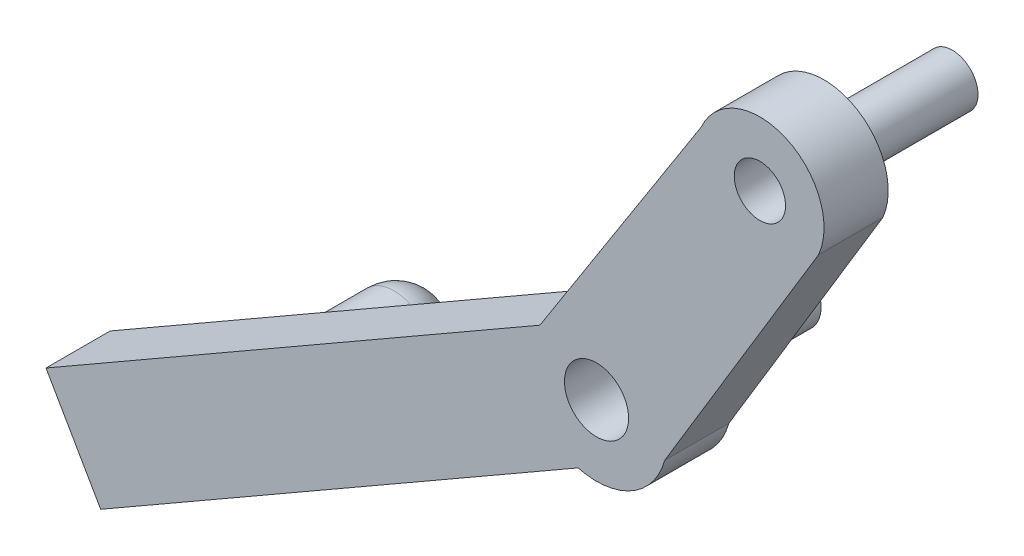
ISO-10303-21;
HEADER;
FILE_DESCRIPTION(('STEP AP214'),'2;1');
FILE_NAME('part.step','',(''),(''),'','','');
FILE_SCHEMA(('AUTOMOTIVE_DESIGN { 1 0 10303 214 1 1 1 1 }'));
ENDSEC;
DATA;
#1=APPLICATION_CONTEXT('core data for automotive mechanical design processes');
#2=APPLICATION_PROTOCOL_DEFINITION('international standard','automotive_design',2000,#1);
#3=PRODUCT_CONTEXT('',#1,'mechanical');
#4=PRODUCT('Part','Part','',(#3));
#5=PRODUCT_RELATED_PRODUCT_CATEGORY('part','',(#4));
#6=PRODUCT_DEFINITION_FORMATION('','',#4);
#7=PRODUCT_DEFINITION_CONTEXT('part definition',#1,'design');
#8=PRODUCT_DEFINITION('design','',#6,#7);
#9=PRODUCT_DEFINITION_SHAPE('','',#8);
#10=(LENGTH_UNIT() NAMED_UNIT(*) SI_UNIT(.MILLI.,.METRE.));
#11=(NAMED_UNIT(*) PLANE_ANGLE_UNIT() SI_UNIT($,.RADIAN.));
#12=(NAMED_UNIT(*) SI_UNIT($,.STERADIAN.) SOLID_ANGLE_UNIT());
#13=UNCERTAINTY_MEASURE_WITH_UNIT(LENGTH_MEASURE(1.E-05),#10,'distance_accuracy_value','');
#14=(GEOMETRIC_REPRESENTATION_CONTEXT(3) GLOBAL_UNCERTAINTY_ASSIGNED_CONTEXT((#13)) GLOBAL_UNIT_ASSIGNED_CONTEXT((#10,
#11,#12)) REPRESENTATION_CONTEXT('',''));
#15=CARTESIAN_POINT('',(0.,0.,0.));
#16=DIRECTION('',(0.,0.,1.));
#17=DIRECTION('',(1.,0.,0.));
#18=AXIS2_PLACEMENT_3D('',#15,#16,#17);
#19=CARTESIAN_POINT('',(2.48034743292827,-4.35301832543163,-15.));
#20=DIRECTION('',(0.,0.,1.));
#21=DIRECTION('',(-1.,0.,0.));
#22=AXIS2_PLACEMENT_3D('',#19,#20,#21);
#23=CYLINDRICAL_SURFACE('',#22,2.5);
#24=CARTESIAN_POINT('',(2.48034743292827,-4.35301832543163,-15.));
#25=DIRECTION('',(0.,0.,1.));
#26=DIRECTION('',(1.,0.,0.));
#27=AXIS2_PLACEMENT_3D('',#24,#25,#26);
#28=CIRCLE('',#27,2.5);
#29=CARTESIAN_POINT('',(4.98034743292827,-4.35301832543163,-15.));
#30=VERTEX_POINT('',#29);
#31=EDGE_CURVE('E11',#30,#30,#28,.T.);
#32=ORIENTED_EDGE('',*,*,#31,.T.);
#33=EDGE_LOOP('',(#32));
#34=FACE_BOUND('',#33,.T.);
#35=CARTESIAN_POINT('',(2.48034743292827,-4.35301832543163,-5.));
#36=DIRECTION('',(0.,0.,1.));
#37=DIRECTION('',(1.,0.,0.));
#38=AXIS2_PLACEMENT_3D('',#35,#36,#37);
#39=CIRCLE('',#38,2.5);
#40=CARTESIAN_POINT('',(4.98034743292827,-4.35301832543163,-5.));
#41=VERTEX_POINT('',#40);
#42=EDGE_CURVE('E47',#41,#41,#39,.T.);
#43=ORIENTED_EDGE('',*,*,#42,.F.);
#44=EDGE_LOOP('',(#43));
#45=FACE_BOUND('',#44,.T.);
#46=ADVANCED_FACE('F44',(#34,#45),#23,.T.);
#47=CARTESIAN_POINT('',(2.48034743292827,-4.35301832543163,-15.));
#48=DIRECTION('',(0.,0.,-1.));
#49=DIRECTION('',(1.,0.,0.));
#50=AXIS2_PLACEMENT_3D('',#47,#48,#49);
#51=PLANE('',#50);
#52=ORIENTED_EDGE('',*,*,#31,.F.);
#53=EDGE_LOOP('',(#52));
#54=FACE_BOUND('',#53,.T.);
#55=ADVANCED_FACE('F59',(#54),#51,.T.);
#56=CARTESIAN_POINT('',(2.48034743292827,-4.35301832543163,-5.));
#57=DIRECTION('',(0.,0.,-1.));
#58=DIRECTION('',(1.,0.,0.));
#59=AXIS2_PLACEMENT_3D('',#56,#57,#58);
#60=PLANE('',#59);
#61=ORIENTED_EDGE('',*,*,#42,.T.);
#62=EDGE_LOOP('',(#61));
#63=FACE_BOUND('',#62,.T.);
#64=ADVANCED_FACE('F56',(#63),#60,.F.);
#65=CLOSED_SHELL('',(#46,#55,#64));
#66=MANIFOLD_SOLID_BREP('B2',#65);
#67=CARTESIAN_POINT('',(15.2131519884464,16.1187767320402,-15.));
#68=DIRECTION('',(0.,0.,1.));
#69=DIRECTION('',(-1.,0.,0.));
#70=AXIS2_PLACEMENT_3D('',#67,#68,#69);
#71=CYLINDRICAL_SURFACE('',#70,2.);
#72=CARTESIAN_POINT('',(15.2131519884464,16.1187767320402,-15.));
#73=DIRECTION('',(0.,0.,1.));
#74=DIRECTION('',(1.,0.,0.));
#75=AXIS2_PLACEMENT_3D('',#72,#73,#74);
#76=CIRCLE('',#75,2.);
#77=CARTESIAN_POINT('',(17.2131519884464,16.1187767320402,-15.));
#78=VERTEX_POINT('',#77);
#79=EDGE_CURVE('E43',#78,#78,#76,.T.);
#80=ORIENTED_EDGE('',*,*,#79,.T.);
#81=EDGE_LOOP('',(#80));
#82=FACE_BOUND('',#81,.T.);
#83=CARTESIAN_POINT('',(15.2131519884464,16.1187767320402,-5.));
#84=DIRECTION('',(0.,0.,1.));
#85=DIRECTION('',(1.,0.,0.));
#86=AXIS2_PLACEMENT_3D('',#83,#84,#85);
#87=CIRCLE('',#86,2.);
#88=CARTESIAN_POINT('',(17.2131519884464,16.1187767320402,-5.));
#89=VERTEX_POINT('',#88);
#90=EDGE_CURVE('E97',#89,#89,#87,.T.);
#91=ORIENTED_EDGE('',*,*,#90,.F.);
#92=EDGE_LOOP('',(#91));
#93=FACE_BOUND('',#92,.T.);
#94=ADVANCED_FACE('F94',(#82,#93),#71,.T.);
#95=CARTESIAN_POINT('',(15.2131519884464,16.1187767320402,-15.));
#96=DIRECTION('',(0.,0.,-1.));
#97=DIRECTION('',(1.,0.,0.));
#98=AXIS2_PLACEMENT_3D('',#95,#96,#97);
#99=PLANE('',#98);
#100=ORIENTED_EDGE('',*,*,#79,.F.);
#101=EDGE_LOOP('',(#100));
#102=FACE_BOUND('',#101,.T.);
#103=ADVANCED_FACE('F109',(#102),#99,.T.);
#104=CARTESIAN_POINT('',(15.2131519884464,16.1187767320402,-5.));
#105=DIRECTION('',(0.,0.,-1.));
#106=DIRECTION('',(1.,0.,0.));
#107=AXIS2_PLACEMENT_3D('',#104,#105,#106);
#108=PLANE('',#107);
#109=ORIENTED_EDGE('',*,*,#90,.T.);
#110=EDGE_LOOP('',(#109));
#111=FACE_BOUND('',#110,.T.);
#112=ADVANCED_FACE('F106',(#111),#108,.F.);
#113=CLOSED_SHELL('',(#94,#103,#112));
#114=MANIFOLD_SOLID_BREP('B6',#113);
#115=CARTESIAN_POINT('',(-25.2931810081454,-19.8826359089883,-15.));
#116=DIRECTION('',(0.,0.,1.));
#117=DIRECTION('',(-1.,0.,0.));
#118=AXIS2_PLACEMENT_3D('',#115,#116,#117);
#119=CYLINDRICAL_SURFACE('',#118,3.);
#120=CARTESIAN_POINT('',(-25.2931810081454,-19.8826359089883,-5.));
#121=DIRECTION('',(0.,0.,1.));
#122=DIRECTION('',(1.,0.,0.));
#123=AXIS2_PLACEMENT_3D('',#120,#121,#122);
#124=CIRCLE('',#123,3.);
#125=CARTESIAN_POINT('',(-22.2931810081454,-19.8826359089883,-5.));
#126=VERTEX_POINT('',#125);
#127=EDGE_CURVE('E237',#126,#126,#124,.T.);
#128=ORIENTED_EDGE('',*,*,#127,.F.);
#129=EDGE_LOOP('',(#128));
#130=FACE_BOUND('',#129,.T.);
#131=CARTESIAN_POINT('',(-25.2931810081454,-19.8826359089884,-12.));
#132=DIRECTION('',(0.,0.,1.));
#133=DIRECTION('',(1.,0.,0.));
#134=AXIS2_PLACEMENT_3D('',#131,#132,#133);
#135=CIRCLE('',#134,3.);
#136=CARTESIAN_POINT('',(-22.2931810081454,-19.8826359089884,-12.));
#137=VERTEX_POINT('',#136);
#138=EDGE_CURVE('E414',#137,#137,#135,.T.);
#139=ORIENTED_EDGE('',*,*,#138,.T.);
#140=EDGE_LOOP('',(#139));
#141=FACE_BOUND('',#140,.T.);
#142=ADVANCED_FACE('F135',(#130,#141),#119,.T.);
#143=CARTESIAN_POINT('',(-0.682703439514869,0.436635830889686,-5.));
#144=DIRECTION('',(-0.842436284988127,0.538795977838925,0.));
#145=DIRECTION('',(-0.538795977838925,-0.842436284988127,0.));
#146=AXIS2_PLACEMENT_3D('',#143,#144,#145);
#147=PLANE('',#146);
#148=DIRECTION('',(0.538795977838925,0.842436284988127,0.));
#149=VECTOR('',#148,1.);
#150=CARTESIAN_POINT('',(-0.682703439514869,0.436635830889686,0.));
#151=LINE('',#150,#149);
#152=CARTESIAN_POINT('',(-1.93424021867878,-1.52020875988425,0.));
#153=VERTEX_POINT('',#152);
#154=CARTESIAN_POINT('',(10.6400793801503,18.1404114466345,0.));
#155=VERTEX_POINT('',#154);
#156=EDGE_CURVE('E233',#153,#155,#151,.T.);
#157=ORIENTED_EDGE('',*,*,#156,.T.);
#158=DIRECTION('',(0.,0.,1.));
#159=VECTOR('',#158,1.);
#160=CARTESIAN_POINT('',(10.6400793801503,18.1404114466345,-5.));
#161=LINE('',#160,#159);
#162=CARTESIAN_POINT('',(10.6400793801503,18.1404114466345,-5.));
#163=VERTEX_POINT('',#162);
#164=EDGE_CURVE('E232',#163,#155,#161,.T.);
#165=ORIENTED_EDGE('',*,*,#164,.F.);
#166=DIRECTION('',(0.538795977838925,0.842436284988127,0.));
#167=VECTOR('',#166,1.);
#168=CARTESIAN_POINT('',(-0.682703439514869,0.436635830889686,-5.));
#169=LINE('',#168,#167);
#170=CARTESIAN_POINT('',(-1.93424021867878,-1.52020875988425,-5.));
#171=VERTEX_POINT('',#170);
#172=EDGE_CURVE('E255',#171,#163,#169,.T.);
#173=ORIENTED_EDGE('',*,*,#172,.F.);
#174=DIRECTION('',(0.,0.,1.));
#175=VECTOR('',#174,1.);
#176=CARTESIAN_POINT('',(-1.93424021867878,-1.52020875988425,-5.));
#177=LINE('',#176,#175);
#178=EDGE_CURVE('E92',#171,#153,#177,.T.);
#179=ORIENTED_EDGE('',*,*,#178,.T.);
#180=EDGE_LOOP('',(#157,#165,#173,#179));
#181=FACE_BOUND('',#180,.T.);
#182=ADVANCED_FACE('F137',(#181),#147,.T.);
#183=CARTESIAN_POINT('',(0.17625658415401,-0.30648591573246,-5.));
#184=DIRECTION('',(-0.498528903536302,0.866873077410351,0.));
#185=DIRECTION('',(-0.866873077410351,-0.498528903536302,0.));
#186=AXIS2_PLACEMENT_3D('',#183,#184,#185);
#187=PLANE('',#186);
#188=DIRECTION('',(0.866873077410351,0.498528903536302,0.));
#189=VECTOR('',#188,1.);
#190=CARTESIAN_POINT('',(0.17625658415401,-0.30648591573246,0.));
#191=LINE('',#190,#189);
#192=CARTESIAN_POINT('',(-40.4263847840177,-23.6566057999731,0.));
#193=VERTEX_POINT('',#192);
#194=EDGE_CURVE('E236',#193,#153,#191,.T.);
#195=ORIENTED_EDGE('',*,*,#194,.T.);
#196=ORIENTED_EDGE('',*,*,#178,.F.);
#197=DIRECTION('',(0.866873077410351,0.498528903536302,0.));
#198=VECTOR('',#197,1.);
#199=CARTESIAN_POINT('',(0.17625658415401,-0.30648591573246,-5.));
#200=LINE('',#199,#198);
#201=CARTESIAN_POINT('',(-40.4263847840177,-23.6566057999731,-5.));
#202=VERTEX_POINT('',#201);
#203=EDGE_CURVE('E187',#202,#171,#200,.T.);
#204=ORIENTED_EDGE('',*,*,#203,.F.);
#205=DIRECTION('',(0.,0.,1.));
#206=VECTOR('',#205,1.);
#207=CARTESIAN_POINT('',(-40.4263847840177,-23.6566057999731,-5.));
#208=LINE('',#207,#206);
#209=EDGE_CURVE('E144',#202,#193,#208,.T.);
#210=ORIENTED_EDGE('',*,*,#209,.T.);
#211=EDGE_LOOP('',(#195,#196,#204,#210));
#212=FACE_BOUND('',#211,.T.);
#213=ADVANCED_FACE('F265',(#212),#187,.T.);
#214=CARTESIAN_POINT('',(-40.6026413681717,-23.3501198842406,-5.));
#215=DIRECTION('',(0.866873077410351,0.498528903536302,0.));
#216=DIRECTION('',(-0.498528903536302,0.866873077410351,0.));
#217=AXIS2_PLACEMENT_3D('',#214,#215,#216);
#218=PLANE('',#217);
#219=DIRECTION('',(0.498528903536302,-0.866873077410351,0.));
#220=VECTOR('',#219,1.);
#221=CARTESIAN_POINT('',(-40.6026413681717,-23.3501198842406,0.));
#222=LINE('',#221,#220);
#223=CARTESIAN_POINT('',(-36.1661695545836,-31.0645331240926,0.));
#224=VERTEX_POINT('',#223);
#225=EDGE_CURVE('E239',#193,#224,#222,.T.);
#226=ORIENTED_EDGE('',*,*,#225,.F.);
#227=ORIENTED_EDGE('',*,*,#209,.F.);
#228=DIRECTION('',(0.498528903536302,-0.866873077410351,0.));
#229=VECTOR('',#228,1.);
#230=CARTESIAN_POINT('',(-40.6026413681717,-23.3501198842406,-5.));
#231=LINE('',#230,#229);
#232=CARTESIAN_POINT('',(-36.1661695545836,-31.0645331240926,-5.));
#233=VERTEX_POINT('',#232);
#234=EDGE_CURVE('E221',#202,#233,#231,.T.);
#235=ORIENTED_EDGE('',*,*,#234,.T.);
#236=DIRECTION('',(0.,0.,1.));
#237=VECTOR('',#236,1.);
#238=CARTESIAN_POINT('',(-36.1661695545836,-31.0645331240926,-5.));
#239=LINE('',#238,#237);
#240=EDGE_CURVE('E259',#233,#224,#239,.T.);
#241=ORIENTED_EDGE('',*,*,#240,.T.);
#242=EDGE_LOOP('',(#226,#227,#235,#241));
#243=FACE_BOUND('',#242,.T.);
#244=ADVANCED_FACE('F277',(#243),#218,.F.);
#245=CARTESIAN_POINT('',(4.43647181358803,-7.71441323985198,-5.));
#246=DIRECTION('',(-0.498528903536302,0.866873077410351,0.));
#247=DIRECTION('',(-0.866873077410351,-0.498528903536302,0.));
#248=AXIS2_PLACEMENT_3D('',#245,#246,#247);
#249=PLANE('',#248);
#250=DIRECTION('',(0.866873077410351,0.498528903536302,0.));
#251=VECTOR('',#250,1.);
#252=CARTESIAN_POINT('',(4.43647181358803,-7.71441323985198,0.));
#253=LINE('',#252,#251);
#254=CARTESIAN_POINT('',(1.04782478556533,-9.66318582418271,0.));
#255=VERTEX_POINT('',#254);
#256=EDGE_CURVE('E242',#224,#255,#253,.T.);
#257=ORIENTED_EDGE('',*,*,#256,.F.);
#258=ORIENTED_EDGE('',*,*,#240,.F.);
#259=DIRECTION('',(0.866873077410351,0.498528903536302,0.));
#260=VECTOR('',#259,1.);
#261=CARTESIAN_POINT('',(4.43647181358803,-7.71441323985198,-5.));
#262=LINE('',#261,#260);
#263=CARTESIAN_POINT('',(1.04782478556533,-9.66318582418271,-5.));
#264=VERTEX_POINT('',#263);
#265=EDGE_CURVE('E219',#233,#264,#262,.T.);
#266=ORIENTED_EDGE('',*,*,#265,.T.);
#267=DIRECTION('',(0.,0.,1.));
#268=VECTOR('',#267,1.);
#269=CARTESIAN_POINT('',(1.04782478556533,-9.66318582418271,-5.));
#270=LINE('',#269,#268);
#271=EDGE_CURVE('E213',#264,#255,#270,.T.);
#272=ORIENTED_EDGE('',*,*,#271,.T.);
#273=EDGE_LOOP('',(#257,#258,#266,#272));
#274=FACE_BOUND('',#273,.T.);
#275=ADVANCED_FACE('F280',(#274),#249,.F.);
#276=CARTESIAN_POINT('',(2.48034743292827,-4.35301832543163,-5.));
#277=DIRECTION('',(0.,0.,1.));
#278=DIRECTION('',(-1.,0.,0.));
#279=AXIS2_PLACEMENT_3D('',#276,#277,#278);
#280=CYLINDRICAL_SURFACE('',#279,5.5);
#281=CARTESIAN_POINT('',(2.48034743292827,-4.35301832543163,0.));
#282=DIRECTION('',(0.,0.,1.));
#283=DIRECTION('',(1.,0.,0.));
#284=AXIS2_PLACEMENT_3D('',#281,#282,#283);
#285=CIRCLE('',#284,5.5);
#286=CARTESIAN_POINT('',(7.79051493167935,-5.78554097279456,0.));
#287=VERTEX_POINT('',#286);
#288=EDGE_CURVE('E245',#255,#287,#285,.T.);
#289=ORIENTED_EDGE('',*,*,#288,.F.);
#290=ORIENTED_EDGE('',*,*,#271,.F.);
#291=CARTESIAN_POINT('',(2.48034743292827,-4.35301832543163,-5.));
#292=DIRECTION('',(0.,0.,1.));
#293=DIRECTION('',(1.,0.,0.));
#294=AXIS2_PLACEMENT_3D('',#291,#292,#293);
#295=CIRCLE('',#294,5.5);
#296=CARTESIAN_POINT('',(7.79051493167935,-5.78554097279456,-5.));
#297=VERTEX_POINT('',#296);
#298=EDGE_CURVE('E203',#264,#297,#295,.T.);
#299=ORIENTED_EDGE('',*,*,#298,.T.);
#300=DIRECTION('',(0.,0.,1.));
#301=VECTOR('',#300,1.);
#302=CARTESIAN_POINT('',(7.79051493167935,-5.78554097279456,-5.));
#303=LINE('',#302,#301);
#304=EDGE_CURVE('E208',#297,#287,#303,.T.);
#305=ORIENTED_EDGE('',*,*,#304,.T.);
#306=EDGE_LOOP('',(#289,#290,#299,#305));
#307=FACE_BOUND('',#306,.T.);
#308=ADVANCED_FACE('F216',(#307),#280,.T.);
#309=CARTESIAN_POINT('',(8.27057905312399,-4.98984292672802,-5.));
#310=DIRECTION('',(-0.856234541670631,0.51658727205583,0.));
#311=DIRECTION('',(-0.51658727205583,-0.856234541670632,0.));
#312=AXIS2_PLACEMENT_3D('',#309,#310,#311);
#313=PLANE('',#312);
#314=DIRECTION('',(0.51658727205583,0.856234541670631,0.));
#315=VECTOR('',#314,1.);
#316=CARTESIAN_POINT('',(8.27057905312399,-4.98984292672802,0.));
#317=LINE('',#316,#315);
#318=CARTESIAN_POINT('',(19.7862245967424,14.097142017446,0.));
#319=VERTEX_POINT('',#318);
#320=EDGE_CURVE('E210',#287,#319,#317,.T.);
#321=ORIENTED_EDGE('',*,*,#320,.F.);
#322=ORIENTED_EDGE('',*,*,#304,.F.);
#323=DIRECTION('',(0.51658727205583,0.856234541670631,0.));
#324=VECTOR('',#323,1.);
#325=CARTESIAN_POINT('',(8.27057905312399,-4.98984292672802,-5.));
#326=LINE('',#325,#324);
#327=CARTESIAN_POINT('',(19.7862245967424,14.097142017446,-5.));
#328=VERTEX_POINT('',#327);
#329=EDGE_CURVE('E198',#297,#328,#326,.T.);
#330=ORIENTED_EDGE('',*,*,#329,.T.);
#331=DIRECTION('',(0.,0.,1.));
#332=VECTOR('',#331,1.);
#333=CARTESIAN_POINT('',(19.7862245967424,14.097142017446,-5.));
#334=LINE('',#333,#332);
#335=EDGE_CURVE('E214',#328,#319,#334,.T.);
#336=ORIENTED_EDGE('',*,*,#335,.T.);
#337=EDGE_LOOP('',(#321,#322,#330,#336));
#338=FACE_BOUND('',#337,.T.);
#339=ADVANCED_FACE('F209',(#338),#313,.F.);
#340=CARTESIAN_POINT('',(15.2131519884464,16.1187767320402,-5.));
#341=DIRECTION('',(0.,0.,1.));
#342=DIRECTION('',(-1.,0.,0.));
#343=AXIS2_PLACEMENT_3D('',#340,#341,#342);
#344=CYLINDRICAL_SURFACE('',#343,2.);
#345=CARTESIAN_POINT('',(15.2131519884464,16.1187767320402,-5.));
#346=DIRECTION('',(0.,0.,1.));
#347=DIRECTION('',(1.,0.,0.));
#348=AXIS2_PLACEMENT_3D('',#345,#346,#347);
#349=CIRCLE('',#348,2.);
#350=CARTESIAN_POINT('',(17.2131519884464,16.1187767320402,-5.));
#351=VERTEX_POINT('',#350);
#352=EDGE_CURVE('E226',#351,#351,#349,.T.);
#353=ORIENTED_EDGE('',*,*,#352,.F.);
#354=EDGE_LOOP('',(#353));
#355=FACE_BOUND('',#354,.T.);
#356=CARTESIAN_POINT('',(15.2131519884464,16.1187767320402,0.));
#357=DIRECTION('',(0.,0.,1.));
#358=DIRECTION('',(1.,0.,0.));
#359=AXIS2_PLACEMENT_3D('',#356,#357,#358);
#360=CIRCLE('',#359,2.);
#361=CARTESIAN_POINT('',(17.2131519884464,16.1187767320402,0.));
#362=VERTEX_POINT('',#361);
#363=EDGE_CURVE('E249',#362,#362,#360,.T.);
#364=ORIENTED_EDGE('',*,*,#363,.T.);
#365=EDGE_LOOP('',(#364));
#366=FACE_BOUND('',#365,.T.);
#367=ADVANCED_FACE('F312',(#355,#366),#344,.F.);
#368=CARTESIAN_POINT('',(15.2131519884464,16.1187767320402,-5.));
#369=DIRECTION('',(0.,0.,1.));
#370=DIRECTION('',(-1.,0.,0.));
#371=AXIS2_PLACEMENT_3D('',#368,#369,#370);
#372=CYLINDRICAL_SURFACE('',#371,5.);
#373=CARTESIAN_POINT('',(15.2131519884464,16.1187767320402,0.));
#374=DIRECTION('',(0.,0.,1.));
#375=DIRECTION('',(1.,0.,0.));
#376=AXIS2_PLACEMENT_3D('',#373,#374,#375);
#377=CIRCLE('',#376,5.);
#378=EDGE_CURVE('E175',#319,#155,#377,.T.);
#379=ORIENTED_EDGE('',*,*,#378,.F.);
#380=ORIENTED_EDGE('',*,*,#335,.F.);
#381=CARTESIAN_POINT('',(15.2131519884464,16.1187767320402,-5.));
#382=DIRECTION('',(0.,0.,1.));
#383=DIRECTION('',(1.,0.,0.));
#384=AXIS2_PLACEMENT_3D('',#381,#382,#383);
#385=CIRCLE('',#384,5.);
#386=EDGE_CURVE('E152',#328,#163,#385,.T.);
#387=ORIENTED_EDGE('',*,*,#386,.T.);
#388=ORIENTED_EDGE('',*,*,#164,.T.);
#389=EDGE_LOOP('',(#379,#380,#387,#388));
#390=FACE_BOUND('',#389,.T.);
#391=ADVANCED_FACE('F310',(#390),#372,.T.);
#392=CARTESIAN_POINT('',(2.48034743292827,-4.35301832543163,-5.));
#393=DIRECTION('',(0.,0.,1.));
#394=DIRECTION('',(-1.,0.,0.));
#395=AXIS2_PLACEMENT_3D('',#392,#393,#394);
#396=CYLINDRICAL_SURFACE('',#395,2.5);
#397=CARTESIAN_POINT('',(2.48034743292827,-4.35301832543163,-5.));
#398=DIRECTION('',(0.,0.,1.));
#399=DIRECTION('',(1.,0.,0.));
#400=AXIS2_PLACEMENT_3D('',#397,#398,#399);
#401=CIRCLE('',#400,2.5);
#402=CARTESIAN_POINT('',(4.98034743292827,-4.35301832543163,-5.));
#403=VERTEX_POINT('',#402);
#404=EDGE_CURVE('E229',#403,#403,#401,.T.);
#405=ORIENTED_EDGE('',*,*,#404,.F.);
#406=EDGE_LOOP('',(#405));
#407=FACE_BOUND('',#406,.T.);
#408=CARTESIAN_POINT('',(2.48034743292827,-4.35301832543163,0.));
#409=DIRECTION('',(0.,0.,1.));
#410=DIRECTION('',(1.,0.,0.));
#411=AXIS2_PLACEMENT_3D('',#408,#409,#410);
#412=CIRCLE('',#411,2.5);
#413=CARTESIAN_POINT('',(4.98034743292827,-4.35301832543163,0.));
#414=VERTEX_POINT('',#413);
#415=EDGE_CURVE('E252',#414,#414,#412,.T.);
#416=ORIENTED_EDGE('',*,*,#415,.T.);
#417=EDGE_LOOP('',(#416));
#418=FACE_BOUND('',#417,.T.);
#419=ADVANCED_FACE('F303',(#407,#418),#396,.F.);
#420=CARTESIAN_POINT('',(0.,0.,-5.));
#421=DIRECTION('',(0.,0.,-1.));
#422=DIRECTION('',(1.,0.,0.));
#423=AXIS2_PLACEMENT_3D('',#420,#421,#422);
#424=PLANE('',#423);
#425=ORIENTED_EDGE('',*,*,#127,.T.);
#426=EDGE_LOOP('',(#425));
#427=FACE_BOUND('',#426,.T.);
#428=ORIENTED_EDGE('',*,*,#172,.T.);
#429=ORIENTED_EDGE('',*,*,#386,.F.);
#430=ORIENTED_EDGE('',*,*,#329,.F.);
#431=ORIENTED_EDGE('',*,*,#298,.F.);
#432=ORIENTED_EDGE('',*,*,#265,.F.);
#433=ORIENTED_EDGE('',*,*,#234,.F.);
#434=ORIENTED_EDGE('',*,*,#203,.T.);
#435=EDGE_LOOP('',(#428,#429,#430,#431,#432,#433,#434));
#436=FACE_BOUND('',#435,.T.);
#437=ORIENTED_EDGE('',*,*,#352,.T.);
#438=EDGE_LOOP('',(#437));
#439=FACE_BOUND('',#438,.T.);
#440=ORIENTED_EDGE('',*,*,#404,.T.);
#441=EDGE_LOOP('',(#440));
#442=FACE_BOUND('',#441,.T.);
#443=ADVANCED_FACE('F200',(#427,#436,#439,#442),#424,.T.);
#444=CARTESIAN_POINT('',(0.,0.,0.));
#445=DIRECTION('',(0.,0.,-1.));
#446=DIRECTION('',(1.,0.,0.));
#447=AXIS2_PLACEMENT_3D('',#444,#445,#446);
#448=PLANE('',#447);
#449=ORIENTED_EDGE('',*,*,#156,.F.);
#450=ORIENTED_EDGE('',*,*,#194,.F.);
#451=ORIENTED_EDGE('',*,*,#225,.T.);
#452=ORIENTED_EDGE('',*,*,#256,.T.);
#453=ORIENTED_EDGE('',*,*,#288,.T.);
#454=ORIENTED_EDGE('',*,*,#320,.T.);
#455=ORIENTED_EDGE('',*,*,#378,.T.);
#456=EDGE_LOOP('',(#449,#450,#451,#452,#453,#454,#455));
#457=FACE_BOUND('',#456,.T.);
#458=ORIENTED_EDGE('',*,*,#363,.F.);
#459=EDGE_LOOP('',(#458));
#460=FACE_BOUND('',#459,.T.);
#461=ORIENTED_EDGE('',*,*,#415,.F.);
#462=EDGE_LOOP('',(#461));
#463=FACE_BOUND('',#462,.T.);
#464=ADVANCED_FACE('F268',(#457,#460,#463),#448,.F.);
#465=CARTESIAN_POINT('',(-25.2931810081454,-19.8826359089884,-12.));
#466=DIRECTION('',(0.,0.,-1.));
#467=DIRECTION('',(1.,0.,0.));
#468=AXIS2_PLACEMENT_3D('',#465,#466,#467);
#469=DEGENERATE_TOROIDAL_SURFACE('',#468,0.250000000000002,3.25,.F.);
#470=ORIENTED_EDGE('',*,*,#138,.F.);
#471=EDGE_LOOP('',(#470));
#472=FACE_BOUND('',#471,.T.);
#473=CARTESIAN_POINT('',(-25.2931810081454,-19.8826359089884,-15.));
#474=DIRECTION('',(0.,0.,1.));
#475=DIRECTION('',(1.,0.,0.));
#476=AXIS2_PLACEMENT_3D('',#473,#474,#475);
#477=CIRCLE('',#476,0.999999999999999);
#478=CARTESIAN_POINT('',(-24.2931810081454,-19.8826359089884,-15.));
#479=VERTEX_POINT('',#478);
#480=EDGE_CURVE('E412',#479,#479,#477,.T.);
#481=ORIENTED_EDGE('',*,*,#480,.T.);
#482=EDGE_LOOP('',(#481));
#483=FACE_BOUND('',#482,.T.);
#484=ADVANCED_FACE('F307',(#472,#483),#469,.F.);
#485=CARTESIAN_POINT('',(-25.2931810081454,-19.8826359089883,-15.));
#486=DIRECTION('',(0.,0.,-1.));
#487=DIRECTION('',(1.,0.,0.));
#488=AXIS2_PLACEMENT_3D('',#485,#486,#487);
#489=PLANE('',#488);
#490=ORIENTED_EDGE('',*,*,#480,.F.);
#491=EDGE_LOOP('',(#490));
#492=FACE_BOUND('',#491,.T.);
#493=ADVANCED_FACE('F299',(#492),#489,.T.);
#494=CLOSED_SHELL('',(#142,#182,#213,#244,#275,#308,#339,#367,#391,#419,#443,#464,#484,#493));
#495=MANIFOLD_SOLID_BREP('B38',#494);
#496=ADVANCED_BREP_SHAPE_REPRESENTATION('',(#18,#66,#114,#495),#14);
#497=SHAPE_DEFINITION_REPRESENTATION(#9,#496);
ENDSEC;
END-ISO-10303-21;
